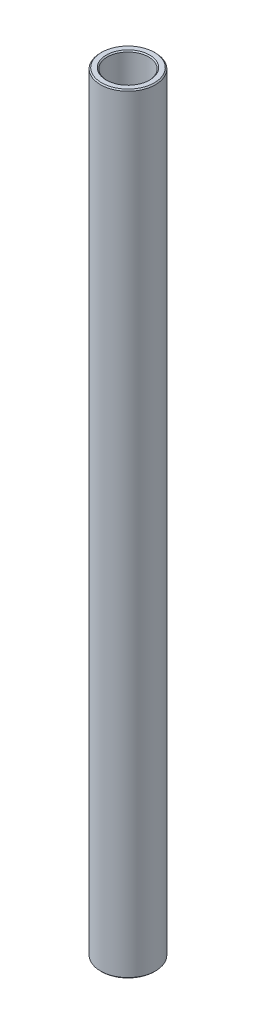
ISO-10303-21;
HEADER;
FILE_DESCRIPTION(('STEP AP214'),'2;1');
FILE_NAME('part.step','',(''),(''),'','','');
FILE_SCHEMA(('AUTOMOTIVE_DESIGN { 1 0 10303 214 1 1 1 1 }'));
ENDSEC;
DATA;
#1=APPLICATION_CONTEXT('core data for automotive mechanical design processes');
#2=APPLICATION_PROTOCOL_DEFINITION('international standard','automotive_design',2000,#1);
#3=PRODUCT_CONTEXT('',#1,'mechanical');
#4=PRODUCT('Part','Part','',(#3));
#5=PRODUCT_RELATED_PRODUCT_CATEGORY('part','',(#4));
#6=PRODUCT_DEFINITION_FORMATION('','',#4);
#7=PRODUCT_DEFINITION_CONTEXT('part definition',#1,'design');
#8=PRODUCT_DEFINITION('design','',#6,#7);
#9=PRODUCT_DEFINITION_SHAPE('','',#8);
#10=(LENGTH_UNIT() NAMED_UNIT(*) SI_UNIT(.MILLI.,.METRE.));
#11=(NAMED_UNIT(*) PLANE_ANGLE_UNIT() SI_UNIT($,.RADIAN.));
#12=(NAMED_UNIT(*) SI_UNIT($,.STERADIAN.) SOLID_ANGLE_UNIT());
#13=UNCERTAINTY_MEASURE_WITH_UNIT(LENGTH_MEASURE(1.E-05),#10,'distance_accuracy_value','');
#14=(GEOMETRIC_REPRESENTATION_CONTEXT(3) GLOBAL_UNCERTAINTY_ASSIGNED_CONTEXT((#13)) GLOBAL_UNIT_ASSIGNED_CONTEXT((#10,
#11,#12)) REPRESENTATION_CONTEXT('',''));
#15=CARTESIAN_POINT('',(0.,0.,0.));
#16=DIRECTION('',(0.,0.,1.));
#17=DIRECTION('',(1.,0.,0.));
#18=AXIS2_PLACEMENT_3D('',#15,#16,#17);
#19=CARTESIAN_POINT('',(0.,11.60859375,0.));
#20=DIRECTION('',(0.,1.,0.));
#21=DIRECTION('',(-1.,0.,0.));
#22=AXIS2_PLACEMENT_3D('',#19,#20,#21);
#23=CYLINDRICAL_SURFACE('',#22,4.7625);
#24=CARTESIAN_POINT('',(0.,-88.646,0.));
#25=DIRECTION('',(0.,1.,0.));
#26=DIRECTION('',(-1.,0.,0.));
#27=AXIS2_PLACEMENT_3D('',#24,#25,#26);
#28=CIRCLE('',#27,4.7625);
#29=CARTESIAN_POINT('',(-4.76250000000001,-88.646,0.));
#30=VERTEX_POINT('',#29);
#31=EDGE_CURVE('E75',#30,#30,#28,.F.);
#32=ORIENTED_EDGE('',*,*,#31,.T.);
#33=EDGE_LOOP('',(#32));
#34=FACE_BOUND('',#33,.T.);
#35=CARTESIAN_POINT('',(0.,88.646,0.));
#36=DIRECTION('',(0.,-1.,0.));
#37=DIRECTION('',(1.,0.,0.));
#38=AXIS2_PLACEMENT_3D('',#35,#36,#37);
#39=CIRCLE('',#38,4.7625);
#40=CARTESIAN_POINT('',(4.76250000000001,88.646,0.));
#41=VERTEX_POINT('',#40);
#42=EDGE_CURVE('E79',#41,#41,#39,.F.);
#43=ORIENTED_EDGE('',*,*,#42,.T.);
#44=EDGE_LOOP('',(#43));
#45=FACE_BOUND('',#44,.T.);
#46=ADVANCED_FACE('F51',(#34,#45),#23,.F.);
#47=CARTESIAN_POINT('',(4.76249999999999,88.9,0.));
#48=DIRECTION('',(0.,-1.,0.));
#49=DIRECTION('',(1.,0.,0.));
#50=AXIS2_PLACEMENT_3D('',#47,#48,#49);
#51=PLANE('',#50);
#52=CARTESIAN_POINT('',(0.,88.9,0.));
#53=DIRECTION('',(0.,-1.,0.));
#54=DIRECTION('',(1.,0.,0.));
#55=AXIS2_PLACEMENT_3D('',#52,#53,#54);
#56=CIRCLE('',#55,6.09599999999999);
#57=CARTESIAN_POINT('',(6.096,88.9,0.));
#58=VERTEX_POINT('',#57);
#59=EDGE_CURVE('E12',#58,#58,#56,.F.);
#60=ORIENTED_EDGE('',*,*,#59,.T.);
#61=EDGE_LOOP('',(#60));
#62=FACE_BOUND('',#61,.T.);
#63=CARTESIAN_POINT('',(0.,88.9,0.));
#64=DIRECTION('',(0.,-1.,0.));
#65=DIRECTION('',(1.,0.,0.));
#66=AXIS2_PLACEMENT_3D('',#63,#64,#65);
#67=CIRCLE('',#66,5.01649999999995);
#68=CARTESIAN_POINT('',(5.01649999999996,88.9,0.));
#69=VERTEX_POINT('',#68);
#70=EDGE_CURVE('E59',#69,#69,#67,.T.);
#71=ORIENTED_EDGE('',*,*,#70,.T.);
#72=EDGE_LOOP('',(#71));
#73=FACE_BOUND('',#72,.T.);
#74=ADVANCED_FACE('F105',(#62,#73),#51,.F.);
#75=CARTESIAN_POINT('',(0.,11.60859375,0.));
#76=DIRECTION('',(0.,1.,0.));
#77=DIRECTION('',(-1.,0.,0.));
#78=AXIS2_PLACEMENT_3D('',#75,#76,#77);
#79=CYLINDRICAL_SURFACE('',#78,6.35);
#80=CARTESIAN_POINT('',(0.,-88.646,0.));
#81=DIRECTION('',(0.,1.,0.));
#82=DIRECTION('',(-1.,0.,0.));
#83=AXIS2_PLACEMENT_3D('',#80,#81,#82);
#84=CIRCLE('',#83,6.35);
#85=CARTESIAN_POINT('',(-6.35000000000001,-88.646,0.));
#86=VERTEX_POINT('',#85);
#87=EDGE_CURVE('E64',#86,#86,#84,.T.);
#88=ORIENTED_EDGE('',*,*,#87,.T.);
#89=EDGE_LOOP('',(#88));
#90=FACE_BOUND('',#89,.T.);
#91=CARTESIAN_POINT('',(0.,88.646,0.));
#92=DIRECTION('',(0.,-1.,0.));
#93=DIRECTION('',(1.,0.,0.));
#94=AXIS2_PLACEMENT_3D('',#91,#92,#93);
#95=CIRCLE('',#94,6.35);
#96=CARTESIAN_POINT('',(6.35000000000001,88.646,0.));
#97=VERTEX_POINT('',#96);
#98=EDGE_CURVE('E69',#97,#97,#95,.T.);
#99=ORIENTED_EDGE('',*,*,#98,.T.);
#100=EDGE_LOOP('',(#99));
#101=FACE_BOUND('',#100,.T.);
#102=ADVANCED_FACE('F102',(#90,#101),#79,.T.);
#103=CARTESIAN_POINT('',(6.35000000000001,-88.9,0.));
#104=DIRECTION('',(0.,1.,0.));
#105=DIRECTION('',(-1.,0.,0.));
#106=AXIS2_PLACEMENT_3D('',#103,#104,#105);
#107=PLANE('',#106);
#108=CARTESIAN_POINT('',(0.,-88.9,0.));
#109=DIRECTION('',(0.,1.,0.));
#110=DIRECTION('',(-1.,0.,0.));
#111=AXIS2_PLACEMENT_3D('',#108,#109,#110);
#112=CIRCLE('',#111,5.01650000000001);
#113=CARTESIAN_POINT('',(-5.01650000000001,-88.9,0.));
#114=VERTEX_POINT('',#113);
#115=EDGE_CURVE('E83',#114,#114,#112,.T.);
#116=ORIENTED_EDGE('',*,*,#115,.T.);
#117=EDGE_LOOP('',(#116));
#118=FACE_BOUND('',#117,.T.);
#119=CARTESIAN_POINT('',(0.,-88.9,0.));
#120=DIRECTION('',(0.,1.,0.));
#121=DIRECTION('',(-1.,0.,0.));
#122=AXIS2_PLACEMENT_3D('',#119,#120,#121);
#123=CIRCLE('',#122,6.09600000000006);
#124=CARTESIAN_POINT('',(-6.09600000000007,-88.9,0.));
#125=VERTEX_POINT('',#124);
#126=EDGE_CURVE('E87',#125,#125,#123,.F.);
#127=ORIENTED_EDGE('',*,*,#126,.T.);
#128=EDGE_LOOP('',(#127));
#129=FACE_BOUND('',#128,.T.);
#130=ADVANCED_FACE('F92',(#118,#129),#107,.F.);
#131=CARTESIAN_POINT('',(0.,-88.9,0.));
#132=DIRECTION('',(0.,-1.,0.));
#133=DIRECTION('',(1.,0.,0.));
#134=AXIS2_PLACEMENT_3D('',#131,#132,#133);
#135=CONICAL_SURFACE('',#134,5.01650000000001,0.785398163397482);
#136=ORIENTED_EDGE('',*,*,#31,.F.);
#137=EDGE_LOOP('',(#136));
#138=FACE_BOUND('',#137,.T.);
#139=ORIENTED_EDGE('',*,*,#115,.F.);
#140=EDGE_LOOP('',(#139));
#141=FACE_BOUND('',#140,.T.);
#142=ADVANCED_FACE('F98',(#138,#141),#135,.F.);
#143=CARTESIAN_POINT('',(0.,-88.646,0.));
#144=DIRECTION('',(0.,1.,0.));
#145=DIRECTION('',(-1.,0.,0.));
#146=AXIS2_PLACEMENT_3D('',#143,#144,#145);
#147=CONICAL_SURFACE('',#146,6.35,0.785398163397406);
#148=ORIENTED_EDGE('',*,*,#126,.F.);
#149=EDGE_LOOP('',(#148));
#150=FACE_BOUND('',#149,.T.);
#151=ORIENTED_EDGE('',*,*,#87,.F.);
#152=EDGE_LOOP('',(#151));
#153=FACE_BOUND('',#152,.T.);
#154=ADVANCED_FACE('F94',(#150,#153),#147,.T.);
#155=CARTESIAN_POINT('',(0.,88.9,0.));
#156=DIRECTION('',(0.,-1.,0.));
#157=DIRECTION('',(1.,0.,0.));
#158=AXIS2_PLACEMENT_3D('',#155,#156,#157);
#159=CONICAL_SURFACE('',#158,6.09599999999999,0.785398163397406);
#160=ORIENTED_EDGE('',*,*,#98,.F.);
#161=EDGE_LOOP('',(#160));
#162=FACE_BOUND('',#161,.T.);
#163=ORIENTED_EDGE('',*,*,#59,.F.);
#164=EDGE_LOOP('',(#163));
#165=FACE_BOUND('',#164,.T.);
#166=ADVANCED_FACE('F97',(#162,#165),#159,.T.);
#167=CARTESIAN_POINT('',(0.,88.646,0.));
#168=DIRECTION('',(0.,1.,0.));
#169=DIRECTION('',(-1.,0.,0.));
#170=AXIS2_PLACEMENT_3D('',#167,#168,#169);
#171=CONICAL_SURFACE('',#170,4.7625,0.785398163397428);
#172=ORIENTED_EDGE('',*,*,#70,.F.);
#173=EDGE_LOOP('',(#172));
#174=FACE_BOUND('',#173,.T.);
#175=ORIENTED_EDGE('',*,*,#42,.F.);
#176=EDGE_LOOP('',(#175));
#177=FACE_BOUND('',#176,.T.);
#178=ADVANCED_FACE('F53',(#174,#177),#171,.F.);
#179=CLOSED_SHELL('',(#46,#74,#102,#130,#142,#154,#166,#178));
#180=MANIFOLD_SOLID_BREP('B2',#179);
#181=ADVANCED_BREP_SHAPE_REPRESENTATION('',(#18,#180),#14);
#182=SHAPE_DEFINITION_REPRESENTATION(#9,#181);
ENDSEC;
END-ISO-10303-21;
